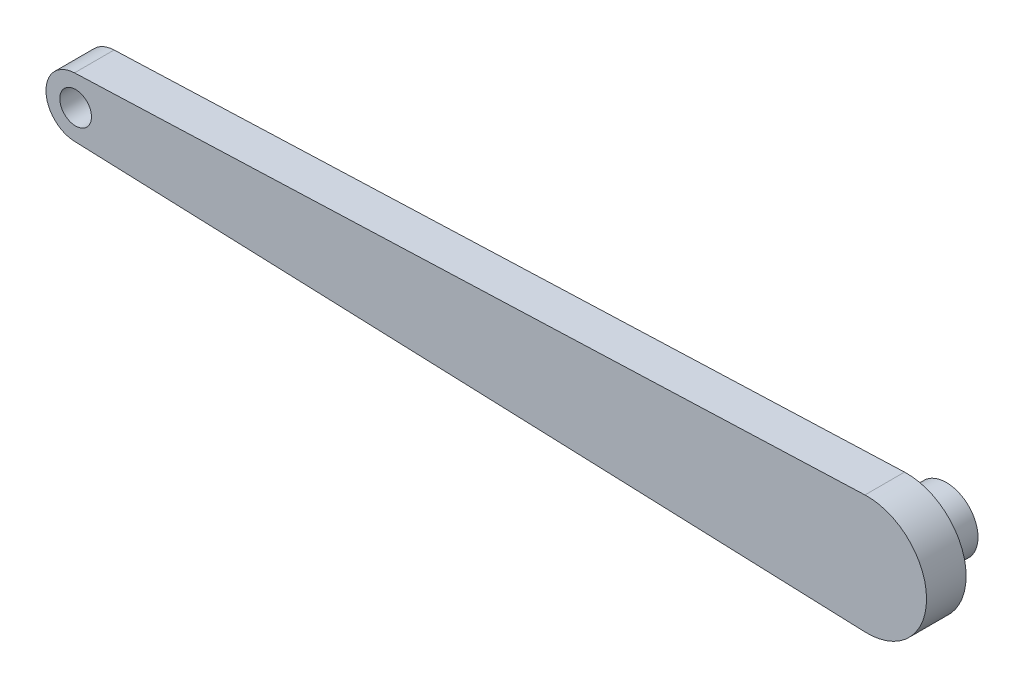
ISO-10303-21;
HEADER;
FILE_DESCRIPTION(('STEP AP214'),'2;1');
FILE_NAME('part.step','',(''),(''),'','','');
FILE_SCHEMA(('AUTOMOTIVE_DESIGN { 1 0 10303 214 1 1 1 1 }'));
ENDSEC;
DATA;
#1=APPLICATION_CONTEXT('core data for automotive mechanical design processes');
#2=APPLICATION_PROTOCOL_DEFINITION('international standard','automotive_design',2000,#1);
#3=PRODUCT_CONTEXT('',#1,'mechanical');
#4=PRODUCT('Part','Part','',(#3));
#5=PRODUCT_RELATED_PRODUCT_CATEGORY('part','',(#4));
#6=PRODUCT_DEFINITION_FORMATION('','',#4);
#7=PRODUCT_DEFINITION_CONTEXT('part definition',#1,'design');
#8=PRODUCT_DEFINITION('design','',#6,#7);
#9=PRODUCT_DEFINITION_SHAPE('','',#8);
#10=(LENGTH_UNIT() NAMED_UNIT(*) SI_UNIT(.MILLI.,.METRE.));
#11=(NAMED_UNIT(*) PLANE_ANGLE_UNIT() SI_UNIT($,.RADIAN.));
#12=(NAMED_UNIT(*) SI_UNIT($,.STERADIAN.) SOLID_ANGLE_UNIT());
#13=UNCERTAINTY_MEASURE_WITH_UNIT(LENGTH_MEASURE(1.E-05),#10,'distance_accuracy_value','');
#14=(GEOMETRIC_REPRESENTATION_CONTEXT(3) GLOBAL_UNCERTAINTY_ASSIGNED_CONTEXT((#13)) GLOBAL_UNIT_ASSIGNED_CONTEXT((#10,
#11,#12)) REPRESENTATION_CONTEXT('',''));
#15=CARTESIAN_POINT('',(0.,0.,0.));
#16=DIRECTION('',(0.,0.,1.));
#17=DIRECTION('',(1.,0.,0.));
#18=AXIS2_PLACEMENT_3D('',#15,#16,#17);
#19=CARTESIAN_POINT('',(0.,0.,0.));
#20=DIRECTION('',(0.,0.,1.));
#21=DIRECTION('',(1.,0.,0.));
#22=AXIS2_PLACEMENT_3D('',#19,#20,#21);
#23=PLANE('',#22);
#24=CARTESIAN_POINT('',(-200.,0.,0.));
#25=DIRECTION('',(0.,0.,1.));
#26=DIRECTION('',(1.,0.,0.));
#27=AXIS2_PLACEMENT_3D('',#24,#25,#26);
#28=CIRCLE('',#27,3.99999999999999);
#29=CARTESIAN_POINT('',(-196.,0.,0.));
#30=VERTEX_POINT('',#29);
#31=EDGE_CURVE('E218',#30,#30,#28,.T.);
#32=ORIENTED_EDGE('',*,*,#31,.T.);
#33=EDGE_LOOP('',(#32));
#34=FACE_BOUND('',#33,.T.);
#35=DIRECTION('',(0.999296627633657,0.0375000000000001,0.));
#36=VECTOR('',#35,1.);
#37=CARTESIAN_POINT('',(-0.562500000000002,14.9894494145049,0.));
#38=LINE('',#37,#36);
#39=CARTESIAN_POINT('',(-200.28125,7.49472470725241,0.));
#40=VERTEX_POINT('',#39);
#41=CARTESIAN_POINT('',(-0.562500000000002,14.9894494145049,0.));
#42=VERTEX_POINT('',#41);
#43=EDGE_CURVE('E102',#40,#42,#38,.T.);
#44=ORIENTED_EDGE('',*,*,#43,.T.);
#45=CARTESIAN_POINT('',(0.,0.,0.));
#46=DIRECTION('',(0.,0.,1.));
#47=DIRECTION('',(1.,0.,0.));
#48=AXIS2_PLACEMENT_3D('',#45,#46,#47);
#49=CIRCLE('',#48,15.);
#50=CARTESIAN_POINT('',(-0.562499999999998,-14.9894494145049,0.));
#51=VERTEX_POINT('',#50);
#52=EDGE_CURVE('E108',#51,#42,#49,.T.);
#53=ORIENTED_EDGE('',*,*,#52,.F.);
#54=DIRECTION('',(0.999296627633657,-0.0374999999999999,0.));
#55=VECTOR('',#54,1.);
#56=CARTESIAN_POINT('',(-0.562499999999998,-14.9894494145049,0.));
#57=LINE('',#56,#55);
#58=CARTESIAN_POINT('',(-200.28125,-7.49472470725246,0.));
#59=VERTEX_POINT('',#58);
#60=EDGE_CURVE('E70',#59,#51,#57,.T.);
#61=ORIENTED_EDGE('',*,*,#60,.F.);
#62=CARTESIAN_POINT('',(-200.,0.,0.));
#63=DIRECTION('',(0.,0.,1.));
#64=DIRECTION('',(1.,0.,0.));
#65=AXIS2_PLACEMENT_3D('',#62,#63,#64);
#66=CIRCLE('',#65,7.50000000000001);
#67=EDGE_CURVE('E94',#40,#59,#66,.T.);
#68=ORIENTED_EDGE('',*,*,#67,.F.);
#69=EDGE_LOOP('',(#44,#53,#61,#68));
#70=FACE_BOUND('',#69,.T.);
#71=CARTESIAN_POINT('',(0.,0.,0.));
#72=DIRECTION('',(0.,0.,1.));
#73=DIRECTION('',(1.,0.,0.));
#74=AXIS2_PLACEMENT_3D('',#71,#72,#73);
#75=CIRCLE('',#74,8.);
#76=CARTESIAN_POINT('',(8.,0.,0.));
#77=VERTEX_POINT('',#76);
#78=EDGE_CURVE('E11',#77,#77,#75,.F.);
#79=ORIENTED_EDGE('',*,*,#78,.F.);
#80=EDGE_LOOP('',(#79));
#81=FACE_BOUND('',#80,.T.);
#82=ADVANCED_FACE('F35',(#34,#70,#81),#23,.F.);
#83=CARTESIAN_POINT('',(-0.562500000000002,14.9894494145049,10.));
#84=DIRECTION('',(-0.0375000000000001,0.999296627633657,0.));
#85=DIRECTION('',(-0.999296627633657,-0.0375000000000001,0.));
#86=AXIS2_PLACEMENT_3D('',#83,#84,#85);
#87=PLANE('',#86);
#88=ORIENTED_EDGE('',*,*,#43,.F.);
#89=DIRECTION('',(0.,0.,-1.));
#90=VECTOR('',#89,1.);
#91=CARTESIAN_POINT('',(-200.28125,7.49472470725241,10.));
#92=LINE('',#91,#90);
#93=CARTESIAN_POINT('',(-200.28125,7.49472470725241,10.));
#94=VERTEX_POINT('',#93);
#95=EDGE_CURVE('E45',#94,#40,#92,.T.);
#96=ORIENTED_EDGE('',*,*,#95,.F.);
#97=DIRECTION('',(0.999296627633657,0.0375000000000001,0.));
#98=VECTOR('',#97,1.);
#99=CARTESIAN_POINT('',(-0.562500000000002,14.9894494145049,10.));
#100=LINE('',#99,#98);
#101=CARTESIAN_POINT('',(-0.562500000000002,14.9894494145049,10.));
#102=VERTEX_POINT('',#101);
#103=EDGE_CURVE('E88',#94,#102,#100,.T.);
#104=ORIENTED_EDGE('',*,*,#103,.T.);
#105=DIRECTION('',(0.,0.,-1.));
#106=VECTOR('',#105,1.);
#107=CARTESIAN_POINT('',(-0.562500000000002,14.9894494145049,10.));
#108=LINE('',#107,#106);
#109=EDGE_CURVE('E77',#102,#42,#108,.T.);
#110=ORIENTED_EDGE('',*,*,#109,.T.);
#111=EDGE_LOOP('',(#88,#96,#104,#110));
#112=FACE_BOUND('',#111,.T.);
#113=ADVANCED_FACE('F37',(#112),#87,.T.);
#114=CARTESIAN_POINT('',(-200.,0.,10.));
#115=DIRECTION('',(0.,0.,-1.));
#116=DIRECTION('',(-1.,0.,0.));
#117=AXIS2_PLACEMENT_3D('',#114,#115,#116);
#118=CYLINDRICAL_SURFACE('',#117,7.50000000000001);
#119=ORIENTED_EDGE('',*,*,#67,.T.);
#120=DIRECTION('',(0.,0.,-1.));
#121=VECTOR('',#120,1.);
#122=CARTESIAN_POINT('',(-200.28125,-7.49472470725246,10.));
#123=LINE('',#122,#121);
#124=CARTESIAN_POINT('',(-200.28125,-7.49472470725246,10.));
#125=VERTEX_POINT('',#124);
#126=EDGE_CURVE('E91',#125,#59,#123,.T.);
#127=ORIENTED_EDGE('',*,*,#126,.F.);
#128=CARTESIAN_POINT('',(-200.,0.,10.));
#129=DIRECTION('',(0.,0.,1.));
#130=DIRECTION('',(1.,0.,0.));
#131=AXIS2_PLACEMENT_3D('',#128,#129,#130);
#132=CIRCLE('',#131,7.50000000000001);
#133=EDGE_CURVE('E83',#94,#125,#132,.T.);
#134=ORIENTED_EDGE('',*,*,#133,.F.);
#135=ORIENTED_EDGE('',*,*,#95,.T.);
#136=EDGE_LOOP('',(#119,#127,#134,#135));
#137=FACE_BOUND('',#136,.T.);
#138=ADVANCED_FACE('F92',(#137),#118,.T.);
#139=CARTESIAN_POINT('',(-0.562499999999998,-14.9894494145049,10.));
#140=DIRECTION('',(0.0374999999999998,0.999296627633657,0.));
#141=DIRECTION('',(-0.999296627633657,0.0374999999999999,0.));
#142=AXIS2_PLACEMENT_3D('',#139,#140,#141);
#143=PLANE('',#142);
#144=ORIENTED_EDGE('',*,*,#60,.T.);
#145=DIRECTION('',(0.,0.,-1.));
#146=VECTOR('',#145,1.);
#147=CARTESIAN_POINT('',(-0.562499999999998,-14.9894494145049,10.));
#148=LINE('',#147,#146);
#149=CARTESIAN_POINT('',(-0.562499999999998,-14.9894494145049,10.));
#150=VERTEX_POINT('',#149);
#151=EDGE_CURVE('E95',#150,#51,#148,.T.);
#152=ORIENTED_EDGE('',*,*,#151,.F.);
#153=DIRECTION('',(0.999296627633657,-0.0374999999999999,0.));
#154=VECTOR('',#153,1.);
#155=CARTESIAN_POINT('',(-0.562499999999998,-14.9894494145049,10.));
#156=LINE('',#155,#154);
#157=EDGE_CURVE('E87',#125,#150,#156,.T.);
#158=ORIENTED_EDGE('',*,*,#157,.F.);
#159=ORIENTED_EDGE('',*,*,#126,.T.);
#160=EDGE_LOOP('',(#144,#152,#158,#159));
#161=FACE_BOUND('',#160,.T.);
#162=ADVANCED_FACE('F97',(#161),#143,.F.);
#163=CARTESIAN_POINT('',(0.,0.,10.));
#164=DIRECTION('',(0.,0.,-1.));
#165=DIRECTION('',(-1.,0.,0.));
#166=AXIS2_PLACEMENT_3D('',#163,#164,#165);
#167=CYLINDRICAL_SURFACE('',#166,15.);
#168=ORIENTED_EDGE('',*,*,#52,.T.);
#169=ORIENTED_EDGE('',*,*,#109,.F.);
#170=CARTESIAN_POINT('',(0.,0.,10.));
#171=DIRECTION('',(0.,0.,1.));
#172=DIRECTION('',(1.,0.,0.));
#173=AXIS2_PLACEMENT_3D('',#170,#171,#172);
#174=CIRCLE('',#173,15.);
#175=EDGE_CURVE('E53',#150,#102,#174,.T.);
#176=ORIENTED_EDGE('',*,*,#175,.F.);
#177=ORIENTED_EDGE('',*,*,#151,.T.);
#178=EDGE_LOOP('',(#168,#169,#176,#177));
#179=FACE_BOUND('',#178,.T.);
#180=ADVANCED_FACE('F128',(#179),#167,.T.);
#181=CARTESIAN_POINT('',(0.,0.,10.));
#182=DIRECTION('',(0.,0.,1.));
#183=DIRECTION('',(1.,0.,0.));
#184=AXIS2_PLACEMENT_3D('',#181,#182,#183);
#185=PLANE('',#184);
#186=CARTESIAN_POINT('',(-200.,0.,10.));
#187=DIRECTION('',(0.,0.,1.));
#188=DIRECTION('',(1.,0.,0.));
#189=AXIS2_PLACEMENT_3D('',#186,#187,#188);
#190=CIRCLE('',#189,3.99999999999999);
#191=CARTESIAN_POINT('',(-196.,0.,10.));
#192=VERTEX_POINT('',#191);
#193=EDGE_CURVE('E39',#192,#192,#190,.T.);
#194=ORIENTED_EDGE('',*,*,#193,.F.);
#195=EDGE_LOOP('',(#194));
#196=FACE_BOUND('',#195,.T.);
#197=ORIENTED_EDGE('',*,*,#103,.F.);
#198=ORIENTED_EDGE('',*,*,#133,.T.);
#199=ORIENTED_EDGE('',*,*,#157,.T.);
#200=ORIENTED_EDGE('',*,*,#175,.T.);
#201=EDGE_LOOP('',(#197,#198,#199,#200));
#202=FACE_BOUND('',#201,.T.);
#203=ADVANCED_FACE('F85',(#196,#202),#185,.T.);
#204=CARTESIAN_POINT('',(0.,0.,-10.));
#205=DIRECTION('',(0.,0.,1.));
#206=DIRECTION('',(1.,0.,0.));
#207=AXIS2_PLACEMENT_3D('',#204,#205,#206);
#208=CYLINDRICAL_SURFACE('',#207,8.);
#209=CARTESIAN_POINT('',(0.,0.,-10.));
#210=DIRECTION('',(0.,0.,-1.));
#211=DIRECTION('',(-1.,0.,0.));
#212=AXIS2_PLACEMENT_3D('',#209,#210,#211);
#213=CIRCLE('',#212,8.);
#214=CARTESIAN_POINT('',(-8.,0.,-10.));
#215=VERTEX_POINT('',#214);
#216=EDGE_CURVE('E105',#215,#215,#213,.T.);
#217=ORIENTED_EDGE('',*,*,#216,.F.);
#218=EDGE_LOOP('',(#217));
#219=FACE_BOUND('',#218,.T.);
#220=ORIENTED_EDGE('',*,*,#78,.T.);
#221=EDGE_LOOP('',(#220));
#222=FACE_BOUND('',#221,.T.);
#223=ADVANCED_FACE('F150',(#219,#222),#208,.T.);
#224=CARTESIAN_POINT('',(0.,0.,-10.));
#225=DIRECTION('',(0.,0.,-1.));
#226=DIRECTION('',(-1.,0.,0.));
#227=AXIS2_PLACEMENT_3D('',#224,#225,#226);
#228=PLANE('',#227);
#229=ORIENTED_EDGE('',*,*,#216,.T.);
#230=EDGE_LOOP('',(#229));
#231=FACE_BOUND('',#230,.T.);
#232=ADVANCED_FACE('F158',(#231),#228,.T.);
#233=CARTESIAN_POINT('',(-200.,0.,60.));
#234=DIRECTION('',(0.,0.,-1.));
#235=DIRECTION('',(-1.,0.,0.));
#236=AXIS2_PLACEMENT_3D('',#233,#234,#235);
#237=CYLINDRICAL_SURFACE('',#236,3.99999999999999);
#238=ORIENTED_EDGE('',*,*,#193,.T.);
#239=EDGE_LOOP('',(#238));
#240=FACE_BOUND('',#239,.T.);
#241=ORIENTED_EDGE('',*,*,#31,.F.);
#242=EDGE_LOOP('',(#241));
#243=FACE_BOUND('',#242,.T.);
#244=ADVANCED_FACE('F166',(#240,#243),#237,.F.);
#245=CLOSED_SHELL('',(#82,#113,#138,#162,#180,#203,#223,#232,#244));
#246=MANIFOLD_SOLID_BREP('B2',#245);
#247=ADVANCED_BREP_SHAPE_REPRESENTATION('',(#18,#246),#14);
#248=SHAPE_DEFINITION_REPRESENTATION(#9,#247);
ENDSEC;
END-ISO-10303-21;
